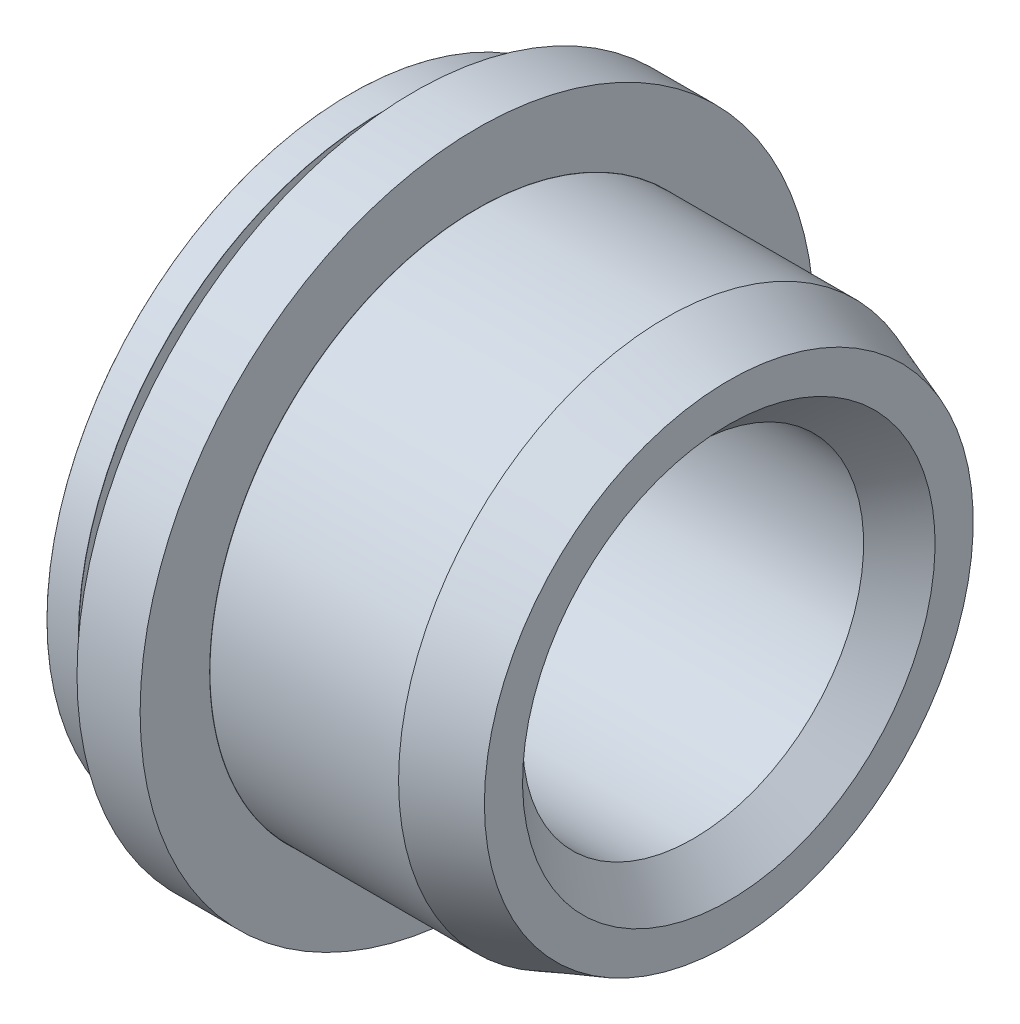
ISO-10303-21;
HEADER;
FILE_DESCRIPTION(('STEP AP214'),'2;1');
FILE_NAME('part.step','',(''),(''),'','','');
FILE_SCHEMA(('AUTOMOTIVE_DESIGN { 1 0 10303 214 1 1 1 1 }'));
ENDSEC;
DATA;
#1=APPLICATION_CONTEXT('core data for automotive mechanical design processes');
#2=APPLICATION_PROTOCOL_DEFINITION('international standard','automotive_design',2000,#1);
#3=PRODUCT_CONTEXT('',#1,'mechanical');
#4=PRODUCT('Part','Part','',(#3));
#5=PRODUCT_RELATED_PRODUCT_CATEGORY('part','',(#4));
#6=PRODUCT_DEFINITION_FORMATION('','',#4);
#7=PRODUCT_DEFINITION_CONTEXT('part definition',#1,'design');
#8=PRODUCT_DEFINITION('design','',#6,#7);
#9=PRODUCT_DEFINITION_SHAPE('','',#8);
#10=(LENGTH_UNIT() NAMED_UNIT(*) SI_UNIT(.MILLI.,.METRE.));
#11=(NAMED_UNIT(*) PLANE_ANGLE_UNIT() SI_UNIT($,.RADIAN.));
#12=(NAMED_UNIT(*) SI_UNIT($,.STERADIAN.) SOLID_ANGLE_UNIT());
#13=UNCERTAINTY_MEASURE_WITH_UNIT(LENGTH_MEASURE(1.E-05),#10,'distance_accuracy_value','');
#14=(GEOMETRIC_REPRESENTATION_CONTEXT(3) GLOBAL_UNCERTAINTY_ASSIGNED_CONTEXT((#13)) GLOBAL_UNIT_ASSIGNED_CONTEXT((#10,
#11,#12)) REPRESENTATION_CONTEXT('',''));
#15=CARTESIAN_POINT('',(0.,0.,0.));
#16=DIRECTION('',(0.,0.,1.));
#17=DIRECTION('',(1.,0.,0.));
#18=AXIS2_PLACEMENT_3D('',#15,#16,#17);
#19=CARTESIAN_POINT('',(0.7633,0.,0.));
#20=DIRECTION('',(1.,0.,0.));
#21=DIRECTION('',(0.,0.,-1.));
#22=AXIS2_PLACEMENT_3D('',#19,#20,#21);
#23=TOROIDAL_SURFACE('',#22,3.3042,0.0016999999999997);
#24=CARTESIAN_POINT('',(0.765,0.,0.));
#25=DIRECTION('',(-1.,0.,0.));
#26=DIRECTION('',(0.,0.,1.));
#27=AXIS2_PLACEMENT_3D('',#24,#25,#26);
#28=CIRCLE('',#27,3.3042);
#29=CARTESIAN_POINT('',(0.765,0.,-3.3042));
#30=VERTEX_POINT('',#29);
#31=CARTESIAN_POINT('',(0.764999999999999,0.,3.3042));
#32=VERTEX_POINT('',#31);
#33=EDGE_CURVE('E63',#30,#32,#28,.F.);
#34=ORIENTED_EDGE('',*,*,#33,.F.);
#35=CARTESIAN_POINT('',(0.765,0.,0.));
#36=DIRECTION('',(-1.,0.,0.));
#37=DIRECTION('',(0.,0.,-1.));
#38=AXIS2_PLACEMENT_3D('',#35,#36,#37);
#39=CIRCLE('',#38,3.3042);
#40=EDGE_CURVE('E66',#32,#30,#39,.F.);
#41=ORIENTED_EDGE('',*,*,#40,.F.);
#42=EDGE_LOOP('',(#34,#41));
#43=FACE_BOUND('',#42,.T.);
#44=CARTESIAN_POINT('',(0.7633,0.,0.));
#45=DIRECTION('',(1.,0.,0.));
#46=DIRECTION('',(0.,0.,-1.));
#47=AXIS2_PLACEMENT_3D('',#44,#45,#46);
#48=CIRCLE('',#47,3.3025);
#49=CARTESIAN_POINT('',(0.763300000000001,0.,-3.3025));
#50=VERTEX_POINT('',#49);
#51=EDGE_CURVE('E75',#50,#50,#48,.F.);
#52=ORIENTED_EDGE('',*,*,#51,.F.);
#53=EDGE_LOOP('',(#52));
#54=FACE_BOUND('',#53,.T.);
#55=ADVANCED_FACE('F16',(#43,#54),#23,.F.);
#56=CARTESIAN_POINT('',(0.764999999999999,0.,3.4946));
#57=DIRECTION('',(-1.,0.,0.));
#58=DIRECTION('',(0.,0.,1.));
#59=AXIS2_PLACEMENT_3D('',#56,#57,#58);
#60=PLANE('',#59);
#61=ORIENTED_EDGE('',*,*,#40,.T.);
#62=ORIENTED_EDGE('',*,*,#33,.T.);
#63=EDGE_LOOP('',(#61,#62));
#64=FACE_BOUND('',#63,.T.);
#65=CARTESIAN_POINT('',(0.765,0.,0.));
#66=DIRECTION('',(-1.,0.,0.));
#67=DIRECTION('',(0.,0.,1.));
#68=AXIS2_PLACEMENT_3D('',#65,#66,#67);
#69=CIRCLE('',#68,4.085);
#70=CARTESIAN_POINT('',(0.764999999999999,0.,4.085));
#71=VERTEX_POINT('',#70);
#72=EDGE_CURVE('E103',#71,#71,#69,.F.);
#73=ORIENTED_EDGE('',*,*,#72,.F.);
#74=EDGE_LOOP('',(#73));
#75=FACE_BOUND('',#74,.T.);
#76=ADVANCED_FACE('F68',(#64,#75),#60,.T.);
#77=CARTESIAN_POINT('',(0.57375,0.,0.));
#78=DIRECTION('',(1.,0.,0.));
#79=DIRECTION('',(0.,0.,-1.));
#80=AXIS2_PLACEMENT_3D('',#77,#78,#79);
#81=CYLINDRICAL_SURFACE('',#80,3.3025);
#82=ORIENTED_EDGE('',*,*,#51,.T.);
#83=EDGE_LOOP('',(#82));
#84=FACE_BOUND('',#83,.T.);
#85=CARTESIAN_POINT('',(0.3842,0.,0.));
#86=DIRECTION('',(1.,0.,0.));
#87=DIRECTION('',(0.,0.,-1.));
#88=AXIS2_PLACEMENT_3D('',#85,#86,#87);
#89=CIRCLE('',#88,3.3025);
#90=CARTESIAN_POINT('',(0.384200000000001,0.,-3.3025));
#91=VERTEX_POINT('',#90);
#92=EDGE_CURVE('E102',#91,#91,#89,.T.);
#93=ORIENTED_EDGE('',*,*,#92,.T.);
#94=EDGE_LOOP('',(#93));
#95=FACE_BOUND('',#94,.T.);
#96=ADVANCED_FACE('F234',(#84,#95),#81,.T.);
#97=CARTESIAN_POINT('',(1.1475,0.,0.));
#98=DIRECTION('',(-1.,0.,0.));
#99=DIRECTION('',(0.,0.,1.));
#100=AXIS2_PLACEMENT_3D('',#97,#98,#99);
#101=CYLINDRICAL_SURFACE('',#100,4.085);
#102=CARTESIAN_POINT('',(1.53,0.,0.));
#103=DIRECTION('',(-1.,0.,0.));
#104=DIRECTION('',(0.,0.,1.));
#105=AXIS2_PLACEMENT_3D('',#102,#103,#104);
#106=CIRCLE('',#105,4.085);
#107=CARTESIAN_POINT('',(1.53,0.,4.085));
#108=VERTEX_POINT('',#107);
#109=EDGE_CURVE('E98',#108,#108,#106,.F.);
#110=ORIENTED_EDGE('',*,*,#109,.F.);
#111=EDGE_LOOP('',(#110));
#112=FACE_BOUND('',#111,.T.);
#113=ORIENTED_EDGE('',*,*,#72,.T.);
#114=EDGE_LOOP('',(#113));
#115=FACE_BOUND('',#114,.T.);
#116=ADVANCED_FACE('F211',(#112,#115),#101,.T.);
#117=CARTESIAN_POINT('',(0.3842,0.,0.));
#118=DIRECTION('',(1.,0.,0.));
#119=DIRECTION('',(0.,0.,-1.));
#120=AXIS2_PLACEMENT_3D('',#117,#118,#119);
#121=TOROIDAL_SURFACE('',#120,3.3042,0.00169999999999959);
#122=ORIENTED_EDGE('',*,*,#92,.F.);
#123=EDGE_LOOP('',(#122));
#124=FACE_BOUND('',#123,.T.);
#125=CARTESIAN_POINT('',(0.3825,0.,0.));
#126=DIRECTION('',(1.,0.,0.));
#127=DIRECTION('',(0.,0.,1.));
#128=AXIS2_PLACEMENT_3D('',#125,#126,#127);
#129=CIRCLE('',#128,3.3042);
#130=CARTESIAN_POINT('',(0.382500000000001,0.,-3.3042));
#131=VERTEX_POINT('',#130);
#132=CARTESIAN_POINT('',(0.382499999999999,0.,3.3042));
#133=VERTEX_POINT('',#132);
#134=EDGE_CURVE('E101',#131,#133,#129,.F.);
#135=ORIENTED_EDGE('',*,*,#134,.F.);
#136=CARTESIAN_POINT('',(0.3825,0.,0.));
#137=DIRECTION('',(1.,0.,0.));
#138=DIRECTION('',(0.,0.,-1.));
#139=AXIS2_PLACEMENT_3D('',#136,#137,#138);
#140=CIRCLE('',#139,3.3042);
#141=EDGE_CURVE('E223',#133,#131,#140,.F.);
#142=ORIENTED_EDGE('',*,*,#141,.F.);
#143=EDGE_LOOP('',(#135,#142));
#144=FACE_BOUND('',#143,.T.);
#145=ADVANCED_FACE('F199',(#124,#144),#121,.F.);
#146=CARTESIAN_POINT('',(1.53,0.,1.8425));
#147=DIRECTION('',(1.,0.,0.));
#148=DIRECTION('',(0.,0.,-1.));
#149=AXIS2_PLACEMENT_3D('',#146,#147,#148);
#150=PLANE('',#149);
#151=CARTESIAN_POINT('',(1.53,0.,0.));
#152=DIRECTION('',(1.,0.,0.));
#153=DIRECTION('',(0.,0.,1.));
#154=AXIS2_PLACEMENT_3D('',#151,#152,#153);
#155=CIRCLE('',#154,3.2417);
#156=CARTESIAN_POINT('',(1.53,0.,-3.2417));
#157=VERTEX_POINT('',#156);
#158=CARTESIAN_POINT('',(1.53,0.,3.2417));
#159=VERTEX_POINT('',#158);
#160=EDGE_CURVE('E182',#157,#159,#155,.F.);
#161=ORIENTED_EDGE('',*,*,#160,.T.);
#162=CARTESIAN_POINT('',(1.53,0.,0.));
#163=DIRECTION('',(1.,0.,0.));
#164=DIRECTION('',(0.,0.,-1.));
#165=AXIS2_PLACEMENT_3D('',#162,#163,#164);
#166=CIRCLE('',#165,3.2417);
#167=EDGE_CURVE('E344',#159,#157,#166,.F.);
#168=ORIENTED_EDGE('',*,*,#167,.T.);
#169=EDGE_LOOP('',(#161,#168));
#170=FACE_BOUND('',#169,.T.);
#171=ORIENTED_EDGE('',*,*,#109,.T.);
#172=EDGE_LOOP('',(#171));
#173=FACE_BOUND('',#172,.T.);
#174=ADVANCED_FACE('F210',(#170,#173),#150,.T.);
#175=CARTESIAN_POINT('',(0.382499999999999,0.,3.49375));
#176=DIRECTION('',(1.,0.,0.));
#177=DIRECTION('',(0.,0.,-1.));
#178=AXIS2_PLACEMENT_3D('',#175,#176,#177);
#179=PLANE('',#178);
#180=CARTESIAN_POINT('',(0.3825,0.,0.));
#181=DIRECTION('',(-1.,0.,0.));
#182=DIRECTION('',(0.,0.,-1.));
#183=AXIS2_PLACEMENT_3D('',#180,#181,#182);
#184=CIRCLE('',#183,3.6833);
#185=CARTESIAN_POINT('',(0.382500000000001,0.,-3.6833));
#186=VERTEX_POINT('',#185);
#187=CARTESIAN_POINT('',(0.382499999999999,0.,3.6833));
#188=VERTEX_POINT('',#187);
#189=EDGE_CURVE('E302',#186,#188,#184,.T.);
#190=ORIENTED_EDGE('',*,*,#189,.F.);
#191=CARTESIAN_POINT('',(0.3825,0.,0.));
#192=DIRECTION('',(-1.,0.,0.));
#193=DIRECTION('',(0.,0.,1.));
#194=AXIS2_PLACEMENT_3D('',#191,#192,#193);
#195=CIRCLE('',#194,3.6833);
#196=EDGE_CURVE('E300',#188,#186,#195,.T.);
#197=ORIENTED_EDGE('',*,*,#196,.F.);
#198=EDGE_LOOP('',(#190,#197));
#199=FACE_BOUND('',#198,.T.);
#200=ORIENTED_EDGE('',*,*,#134,.T.);
#201=ORIENTED_EDGE('',*,*,#141,.T.);
#202=EDGE_LOOP('',(#200,#201));
#203=FACE_BOUND('',#202,.T.);
#204=ADVANCED_FACE('F310',(#199,#203),#179,.T.);
#205=CARTESIAN_POINT('',(1.5317,0.,0.));
#206=DIRECTION('',(1.,0.,0.));
#207=DIRECTION('',(0.,0.,-1.));
#208=AXIS2_PLACEMENT_3D('',#205,#206,#207);
#209=TOROIDAL_SURFACE('',#208,3.2417,0.00169999999999915);
#210=CARTESIAN_POINT('',(1.5317,0.,0.));
#211=DIRECTION('',(1.,0.,0.));
#212=DIRECTION('',(0.,0.,-1.));
#213=AXIS2_PLACEMENT_3D('',#210,#211,#212);
#214=CIRCLE('',#213,3.24);
#215=CARTESIAN_POINT('',(1.5317,0.,-3.24));
#216=VERTEX_POINT('',#215);
#217=EDGE_CURVE('E149',#216,#216,#214,.T.);
#218=ORIENTED_EDGE('',*,*,#217,.F.);
#219=EDGE_LOOP('',(#218));
#220=FACE_BOUND('',#219,.T.);
#221=ORIENTED_EDGE('',*,*,#160,.F.);
#222=ORIENTED_EDGE('',*,*,#167,.F.);
#223=EDGE_LOOP('',(#221,#222));
#224=FACE_BOUND('',#223,.T.);
#225=ADVANCED_FACE('F161',(#220,#224),#209,.F.);
#226=CARTESIAN_POINT('',(0.3808,0.,0.));
#227=DIRECTION('',(1.,0.,0.));
#228=DIRECTION('',(0.,0.,-1.));
#229=AXIS2_PLACEMENT_3D('',#226,#227,#228);
#230=TOROIDAL_SURFACE('',#229,3.6833,0.00169999999999959);
#231=CARTESIAN_POINT('',(0.3808,0.,0.));
#232=DIRECTION('',(1.,0.,0.));
#233=DIRECTION('',(0.,0.,-1.));
#234=AXIS2_PLACEMENT_3D('',#231,#232,#233);
#235=CIRCLE('',#234,3.685);
#236=CARTESIAN_POINT('',(0.380800000000001,0.,-3.685));
#237=VERTEX_POINT('',#236);
#238=EDGE_CURVE('E146',#237,#237,#235,.F.);
#239=ORIENTED_EDGE('',*,*,#238,.F.);
#240=EDGE_LOOP('',(#239));
#241=FACE_BOUND('',#240,.T.);
#242=ORIENTED_EDGE('',*,*,#196,.T.);
#243=ORIENTED_EDGE('',*,*,#189,.T.);
#244=EDGE_LOOP('',(#242,#243));
#245=FACE_BOUND('',#244,.T.);
#246=ADVANCED_FACE('F155',(#241,#245),#230,.T.);
#247=CARTESIAN_POINT('',(2.6746,0.,0.));
#248=DIRECTION('',(1.,0.,0.));
#249=DIRECTION('',(0.,0.,-1.));
#250=AXIS2_PLACEMENT_3D('',#247,#248,#249);
#251=CYLINDRICAL_SURFACE('',#250,3.24);
#252=CARTESIAN_POINT('',(3.81750000002512,0.,0.));
#253=DIRECTION('',(-1.,0.,0.));
#254=DIRECTION('',(0.,0.,1.));
#255=AXIS2_PLACEMENT_3D('',#252,#253,#254);
#256=CIRCLE('',#255,3.24000000000524);
#257=CARTESIAN_POINT('',(3.81750000002512,-2.4935468545972E-13,3.24000000000524));
#258=VERTEX_POINT('',#257);
#259=EDGE_CURVE('E143',#258,#258,#256,.F.);
#260=ORIENTED_EDGE('',*,*,#259,.F.);
#261=EDGE_LOOP('',(#260));
#262=FACE_BOUND('',#261,.T.);
#263=ORIENTED_EDGE('',*,*,#217,.T.);
#264=EDGE_LOOP('',(#263));
#265=FACE_BOUND('',#264,.T.);
#266=ADVANCED_FACE('F160',(#262,#265),#251,.T.);
#267=CARTESIAN_POINT('',(0.19125,0.,0.));
#268=DIRECTION('',(1.,0.,0.));
#269=DIRECTION('',(0.,0.,-1.));
#270=AXIS2_PLACEMENT_3D('',#267,#268,#269);
#271=CYLINDRICAL_SURFACE('',#270,3.685);
#272=ORIENTED_EDGE('',*,*,#238,.T.);
#273=EDGE_LOOP('',(#272));
#274=FACE_BOUND('',#273,.T.);
#275=CARTESIAN_POINT('',(0.0017000000000007,0.,0.));
#276=DIRECTION('',(1.,0.,0.));
#277=DIRECTION('',(0.,0.,-1.));
#278=AXIS2_PLACEMENT_3D('',#275,#276,#277);
#279=CIRCLE('',#278,3.685);
#280=CARTESIAN_POINT('',(0.00170000000000152,0.,-3.685));
#281=VERTEX_POINT('',#280);
#282=EDGE_CURVE('E97',#281,#281,#279,.F.);
#283=ORIENTED_EDGE('',*,*,#282,.F.);
#284=EDGE_LOOP('',(#283));
#285=FACE_BOUND('',#284,.T.);
#286=ADVANCED_FACE('F292',(#274,#285),#271,.T.);
#287=CARTESIAN_POINT('',(3.81750000013881,0.,0.));
#288=DIRECTION('',(-1.,0.,0.));
#289=DIRECTION('',(0.,0.,1.));
#290=AXIS2_PLACEMENT_3D('',#287,#288,#289);
#291=CONICAL_SURFACE('',#290,3.23999999997682,0.349065850421977);
#292=CARTESIAN_POINT('',(4.58000000003267,0.,0.));
#293=DIRECTION('',(-1.,0.,0.));
#294=DIRECTION('',(0.,0.,1.));
#295=AXIS2_PLACEMENT_3D('',#292,#293,#294);
#296=CIRCLE('',#295,2.96247269636751);
#297=CARTESIAN_POINT('',(4.58000000003267,0.,2.96247269636751));
#298=VERTEX_POINT('',#297);
#299=EDGE_CURVE('E94',#298,#298,#296,.F.);
#300=ORIENTED_EDGE('',*,*,#299,.F.);
#301=EDGE_LOOP('',(#300));
#302=FACE_BOUND('',#301,.T.);
#303=ORIENTED_EDGE('',*,*,#259,.T.);
#304=EDGE_LOOP('',(#303));
#305=FACE_BOUND('',#304,.T.);
#306=ADVANCED_FACE('F125',(#302,#305),#291,.T.);
#307=CARTESIAN_POINT('',(0.0017000000000007,0.,0.));
#308=DIRECTION('',(1.,0.,0.));
#309=DIRECTION('',(0.,0.,-1.));
#310=AXIS2_PLACEMENT_3D('',#307,#308,#309);
#311=TOROIDAL_SURFACE('',#310,3.6833,0.00170000000000048);
#312=CARTESIAN_POINT('',(0.,0.,0.));
#313=DIRECTION('',(1.,0.,0.));
#314=DIRECTION('',(0.,0.,1.));
#315=AXIS2_PLACEMENT_3D('',#312,#313,#314);
#316=CIRCLE('',#315,3.6833);
#317=CARTESIAN_POINT('',(0.,0.,-3.6833));
#318=VERTEX_POINT('',#317);
#319=CARTESIAN_POINT('',(0.,0.,3.6833));
#320=VERTEX_POINT('',#319);
#321=EDGE_CURVE('E36',#318,#320,#316,.F.);
#322=ORIENTED_EDGE('',*,*,#321,.F.);
#323=CARTESIAN_POINT('',(0.,0.,0.));
#324=DIRECTION('',(1.,0.,0.));
#325=DIRECTION('',(0.,0.,-1.));
#326=AXIS2_PLACEMENT_3D('',#323,#324,#325);
#327=CIRCLE('',#326,3.6833);
#328=EDGE_CURVE('E93',#320,#318,#327,.F.);
#329=ORIENTED_EDGE('',*,*,#328,.F.);
#330=EDGE_LOOP('',(#322,#329));
#331=FACE_BOUND('',#330,.T.);
#332=ORIENTED_EDGE('',*,*,#282,.T.);
#333=EDGE_LOOP('',(#332));
#334=FACE_BOUND('',#333,.T.);
#335=ADVANCED_FACE('F113',(#331,#334),#311,.T.);
#336=CARTESIAN_POINT('',(4.58,0.,1.48123634818601));
#337=DIRECTION('',(1.,0.,0.));
#338=DIRECTION('',(0.,0.,-1.));
#339=AXIS2_PLACEMENT_3D('',#336,#337,#338);
#340=PLANE('',#339);
#341=ORIENTED_EDGE('',*,*,#299,.T.);
#342=EDGE_LOOP('',(#341));
#343=FACE_BOUND('',#342,.T.);
#344=CARTESIAN_POINT('',(4.58000000003267,0.,0.));
#345=DIRECTION('',(1.,0.,0.));
#346=DIRECTION('',(0.,1.,0.));
#347=AXIS2_PLACEMENT_3D('',#344,#345,#346);
#348=CIRCLE('',#347,2.49999999999773);
#349=CARTESIAN_POINT('',(4.58000000003267,2.49999999999773,0.));
#350=VERTEX_POINT('',#349);
#351=EDGE_CURVE('E90',#350,#350,#348,.F.);
#352=ORIENTED_EDGE('',*,*,#351,.T.);
#353=EDGE_LOOP('',(#352));
#354=FACE_BOUND('',#353,.T.);
#355=ADVANCED_FACE('F124',(#343,#354),#340,.T.);
#356=CARTESIAN_POINT('',(0.,0.,1.84165));
#357=DIRECTION('',(-1.,0.,0.));
#358=DIRECTION('',(0.,0.,1.));
#359=AXIS2_PLACEMENT_3D('',#356,#357,#358);
#360=PLANE('',#359);
#361=ORIENTED_EDGE('',*,*,#321,.T.);
#362=ORIENTED_EDGE('',*,*,#328,.T.);
#363=EDGE_LOOP('',(#361,#362));
#364=FACE_BOUND('',#363,.T.);
#365=CARTESIAN_POINT('',(5.68435719366022E-11,0.,0.));
#366=DIRECTION('',(-1.,0.,0.));
#367=DIRECTION('',(0.,-1.,0.));
#368=AXIS2_PLACEMENT_3D('',#365,#366,#367);
#369=CIRCLE('',#368,2.49999999988404);
#370=CARTESIAN_POINT('',(5.68438780881907E-11,-2.49999999988404,0.));
#371=VERTEX_POINT('',#370);
#372=EDGE_CURVE('E82',#371,#371,#369,.F.);
#373=ORIENTED_EDGE('',*,*,#372,.T.);
#374=EDGE_LOOP('',(#373));
#375=FACE_BOUND('',#374,.T.);
#376=ADVANCED_FACE('F259',(#364,#375),#360,.T.);
#377=CARTESIAN_POINT('',(4.58000000003267,0.,0.));
#378=DIRECTION('',(1.,0.,0.));
#379=DIRECTION('',(0.,1.,0.));
#380=AXIS2_PLACEMENT_3D('',#377,#378,#379);
#381=CONICAL_SURFACE('',#380,2.49999999999773,0.785398163397448);
#382=CARTESIAN_POINT('',(4.147,0.,0.));
#383=DIRECTION('',(-1.,0.,0.));
#384=DIRECTION('',(0.,-1.,0.));
#385=AXIS2_PLACEMENT_3D('',#382,#383,#384);
#386=CIRCLE('',#385,2.067);
#387=CARTESIAN_POINT('',(4.147,-2.067,0.));
#388=VERTEX_POINT('',#387);
#389=EDGE_CURVE('E28',#388,#388,#386,.T.);
#390=ORIENTED_EDGE('',*,*,#389,.T.);
#391=EDGE_LOOP('',(#390));
#392=FACE_BOUND('',#391,.T.);
#393=ORIENTED_EDGE('',*,*,#351,.F.);
#394=EDGE_LOOP('',(#393));
#395=FACE_BOUND('',#394,.T.);
#396=ADVANCED_FACE('F252',(#392,#395),#381,.F.);
#397=CARTESIAN_POINT('',(-1.13686684645822E-10,0.,0.));
#398=DIRECTION('',(-1.,0.,0.));
#399=DIRECTION('',(0.,-1.,0.));
#400=AXIS2_PLACEMENT_3D('',#397,#398,#399);
#401=CONICAL_SURFACE('',#400,2.50000000005457,0.785398163397448);
#402=ORIENTED_EDGE('',*,*,#372,.F.);
#403=EDGE_LOOP('',(#402));
#404=FACE_BOUND('',#403,.T.);
#405=CARTESIAN_POINT('',(0.433,0.,0.));
#406=DIRECTION('',(-1.,0.,0.));
#407=DIRECTION('',(0.,-1.,0.));
#408=AXIS2_PLACEMENT_3D('',#405,#406,#407);
#409=CIRCLE('',#408,2.067);
#410=CARTESIAN_POINT('',(0.433,-2.067,0.));
#411=VERTEX_POINT('',#410);
#412=EDGE_CURVE('E10',#411,#411,#409,.F.);
#413=ORIENTED_EDGE('',*,*,#412,.T.);
#414=EDGE_LOOP('',(#413));
#415=FACE_BOUND('',#414,.T.);
#416=ADVANCED_FACE('F246',(#404,#415),#401,.F.);
#417=CARTESIAN_POINT('',(2.29,0.,0.));
#418=DIRECTION('',(-1.,0.,0.));
#419=DIRECTION('',(0.,-1.,0.));
#420=AXIS2_PLACEMENT_3D('',#417,#418,#419);
#421=CYLINDRICAL_SURFACE('',#420,2.067);
#422=ORIENTED_EDGE('',*,*,#412,.F.);
#423=EDGE_LOOP('',(#422));
#424=FACE_BOUND('',#423,.T.);
#425=ORIENTED_EDGE('',*,*,#389,.F.);
#426=EDGE_LOOP('',(#425));
#427=FACE_BOUND('',#426,.T.);
#428=ADVANCED_FACE('F244',(#424,#427),#421,.F.);
#429=CLOSED_SHELL('',(#55,#76,#96,#116,#145,#174,#204,#225,#246,#266,#286,#306,#335,#355,#376,
#396,#416,#428));
#430=MANIFOLD_SOLID_BREP('B1',#429);
#431=ADVANCED_BREP_SHAPE_REPRESENTATION('',(#18,#430),#14);
#432=SHAPE_DEFINITION_REPRESENTATION(#9,#431);
ENDSEC;
END-ISO-10303-21;
